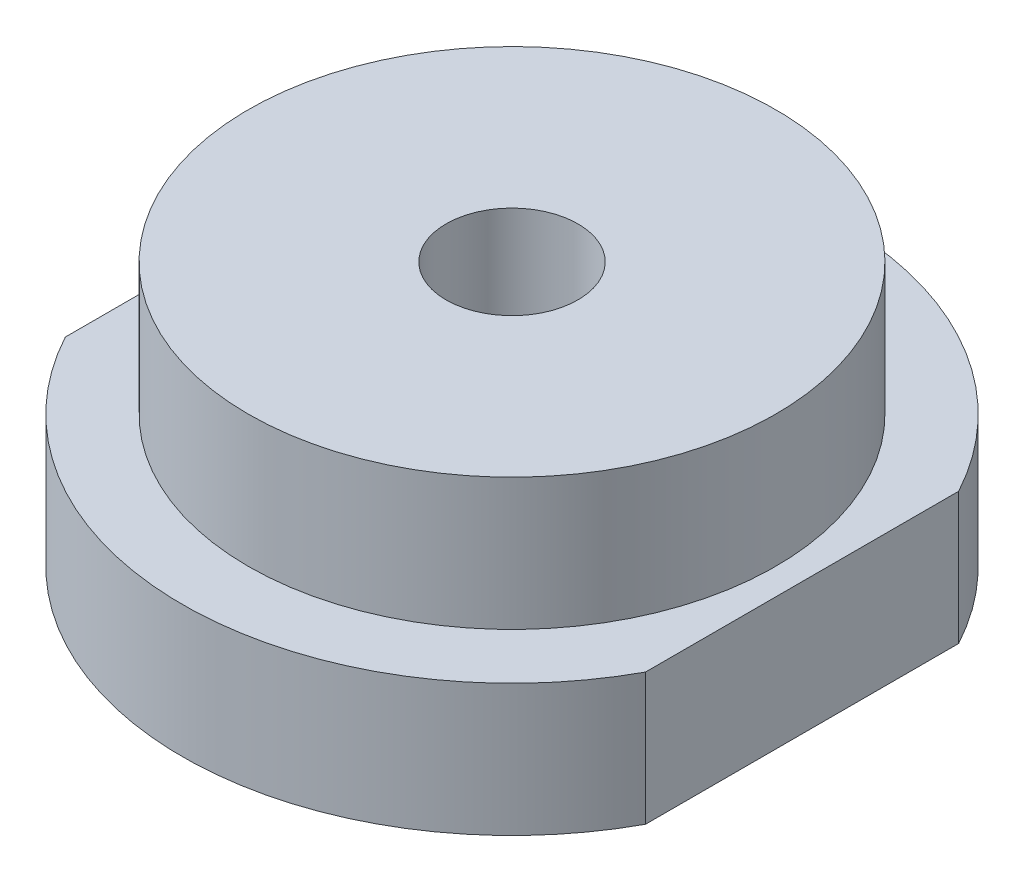
ISO-10303-21;
HEADER;
FILE_DESCRIPTION(('STEP AP214'),'2;1');
FILE_NAME('part.step','',(''),(''),'','','');
FILE_SCHEMA(('AUTOMOTIVE_DESIGN { 1 0 10303 214 1 1 1 1 }'));
ENDSEC;
DATA;
#1=APPLICATION_CONTEXT('core data for automotive mechanical design processes');
#2=APPLICATION_PROTOCOL_DEFINITION('international standard','automotive_design',2000,#1);
#3=PRODUCT_CONTEXT('',#1,'mechanical');
#4=PRODUCT('Part','Part','',(#3));
#5=PRODUCT_RELATED_PRODUCT_CATEGORY('part','',(#4));
#6=PRODUCT_DEFINITION_FORMATION('','',#4);
#7=PRODUCT_DEFINITION_CONTEXT('part definition',#1,'design');
#8=PRODUCT_DEFINITION('design','',#6,#7);
#9=PRODUCT_DEFINITION_SHAPE('','',#8);
#10=(LENGTH_UNIT() NAMED_UNIT(*) SI_UNIT(.MILLI.,.METRE.));
#11=(NAMED_UNIT(*) PLANE_ANGLE_UNIT() SI_UNIT($,.RADIAN.));
#12=(NAMED_UNIT(*) SI_UNIT($,.STERADIAN.) SOLID_ANGLE_UNIT());
#13=UNCERTAINTY_MEASURE_WITH_UNIT(LENGTH_MEASURE(1.E-05),#10,'distance_accuracy_value','');
#14=(GEOMETRIC_REPRESENTATION_CONTEXT(3) GLOBAL_UNCERTAINTY_ASSIGNED_CONTEXT((#13)) GLOBAL_UNIT_ASSIGNED_CONTEXT((#10,
#11,#12)) REPRESENTATION_CONTEXT('',''));
#15=CARTESIAN_POINT('',(0.,0.,0.));
#16=DIRECTION('',(0.,0.,1.));
#17=DIRECTION('',(1.,0.,0.));
#18=AXIS2_PLACEMENT_3D('',#15,#16,#17);
#19=CARTESIAN_POINT('',(0.,5.,0.));
#20=DIRECTION('',(0.,-1.,0.));
#21=DIRECTION('',(0.,0.,-1.));
#22=AXIS2_PLACEMENT_3D('',#19,#20,#21);
#23=CYLINDRICAL_SURFACE('',#22,12.5);
#24=CARTESIAN_POINT('',(0.,5.,0.));
#25=DIRECTION('',(0.,1.,0.));
#26=DIRECTION('',(0.,0.,1.));
#27=AXIS2_PLACEMENT_3D('',#24,#25,#26);
#28=CIRCLE('',#27,12.5);
#29=CARTESIAN_POINT('',(-11.,5.,5.93717104351897));
#30=VERTEX_POINT('',#29);
#31=CARTESIAN_POINT('',(11.,5.,5.93717104351896));
#32=VERTEX_POINT('',#31);
#33=EDGE_CURVE('E93',#30,#32,#28,.T.);
#34=ORIENTED_EDGE('',*,*,#33,.F.);
#35=DIRECTION('',(0.,1.,0.));
#36=VECTOR('',#35,1.);
#37=CARTESIAN_POINT('',(-11.,0.,5.93717104351897));
#38=LINE('',#37,#36);
#39=CARTESIAN_POINT('',(-11.,0.,5.93717104351897));
#40=VERTEX_POINT('',#39);
#41=EDGE_CURVE('E82',#40,#30,#38,.T.);
#42=ORIENTED_EDGE('',*,*,#41,.F.);
#43=CARTESIAN_POINT('',(0.,0.,0.));
#44=DIRECTION('',(0.,1.,0.));
#45=DIRECTION('',(0.,0.,1.));
#46=AXIS2_PLACEMENT_3D('',#43,#44,#45);
#47=CIRCLE('',#46,12.5);
#48=CARTESIAN_POINT('',(11.,0.,5.93717104351896));
#49=VERTEX_POINT('',#48);
#50=EDGE_CURVE('E43',#40,#49,#47,.T.);
#51=ORIENTED_EDGE('',*,*,#50,.T.);
#52=DIRECTION('',(0.,1.,0.));
#53=VECTOR('',#52,1.);
#54=CARTESIAN_POINT('',(11.,0.,5.93717104351896));
#55=LINE('',#54,#53);
#56=EDGE_CURVE('E64',#49,#32,#55,.T.);
#57=ORIENTED_EDGE('',*,*,#56,.T.);
#58=EDGE_LOOP('',(#34,#42,#51,#57));
#59=FACE_BOUND('',#58,.T.);
#60=ADVANCED_FACE('F39',(#59),#23,.T.);
#61=CARTESIAN_POINT('',(11.,0.,-5.93717104351896));
#62=VERTEX_POINT('',#61);
#63=CARTESIAN_POINT('',(-11.,0.,-5.93717104351896));
#64=VERTEX_POINT('',#63);
#65=EDGE_CURVE('E97',#62,#64,#47,.T.);
#66=ORIENTED_EDGE('',*,*,#65,.T.);
#67=DIRECTION('',(0.,1.,0.));
#68=VECTOR('',#67,1.);
#69=CARTESIAN_POINT('',(-11.,0.,-5.93717104351897));
#70=LINE('',#69,#68);
#71=CARTESIAN_POINT('',(-11.,5.,-5.93717104351897));
#72=VERTEX_POINT('',#71);
#73=EDGE_CURVE('E56',#64,#72,#70,.T.);
#74=ORIENTED_EDGE('',*,*,#73,.T.);
#75=CARTESIAN_POINT('',(11.,5.,-5.93717104351896));
#76=VERTEX_POINT('',#75);
#77=EDGE_CURVE('E48',#76,#72,#28,.T.);
#78=ORIENTED_EDGE('',*,*,#77,.F.);
#79=DIRECTION('',(0.,1.,0.));
#80=VECTOR('',#79,1.);
#81=CARTESIAN_POINT('',(11.,0.,-5.93717104351896));
#82=LINE('',#81,#80);
#83=EDGE_CURVE('E115',#62,#76,#82,.T.);
#84=ORIENTED_EDGE('',*,*,#83,.F.);
#85=EDGE_LOOP('',(#66,#74,#78,#84));
#86=FACE_BOUND('',#85,.T.);
#87=ADVANCED_FACE('F41',(#86),#23,.T.);
#88=CARTESIAN_POINT('',(0.,5.,0.));
#89=DIRECTION('',(0.,1.,0.));
#90=DIRECTION('',(0.,0.,1.));
#91=AXIS2_PLACEMENT_3D('',#88,#89,#90);
#92=PLANE('',#91);
#93=DIRECTION('',(0.,0.,-1.));
#94=VECTOR('',#93,1.);
#95=CARTESIAN_POINT('',(-11.,5.,0.));
#96=LINE('',#95,#94);
#97=EDGE_CURVE('E100',#30,#72,#96,.T.);
#98=ORIENTED_EDGE('',*,*,#97,.F.);
#99=ORIENTED_EDGE('',*,*,#33,.T.);
#100=DIRECTION('',(0.,0.,1.));
#101=VECTOR('',#100,1.);
#102=CARTESIAN_POINT('',(11.,5.,0.));
#103=LINE('',#102,#101);
#104=EDGE_CURVE('E104',#76,#32,#103,.T.);
#105=ORIENTED_EDGE('',*,*,#104,.F.);
#106=ORIENTED_EDGE('',*,*,#77,.T.);
#107=EDGE_LOOP('',(#98,#99,#105,#106));
#108=FACE_BOUND('',#107,.T.);
#109=CARTESIAN_POINT('',(0.,5.,0.));
#110=DIRECTION('',(0.,1.,0.));
#111=DIRECTION('',(0.,0.,1.));
#112=AXIS2_PLACEMENT_3D('',#109,#110,#111);
#113=CIRCLE('',#112,10.);
#114=CARTESIAN_POINT('',(0.,5.,10.));
#115=VERTEX_POINT('',#114);
#116=EDGE_CURVE('E11',#115,#115,#113,.T.);
#117=ORIENTED_EDGE('',*,*,#116,.F.);
#118=EDGE_LOOP('',(#117));
#119=FACE_BOUND('',#118,.T.);
#120=ADVANCED_FACE('F111',(#108,#119),#92,.T.);
#121=CARTESIAN_POINT('',(0.,0.,0.));
#122=DIRECTION('',(0.,1.,0.));
#123=DIRECTION('',(0.,0.,1.));
#124=AXIS2_PLACEMENT_3D('',#121,#122,#123);
#125=PLANE('',#124);
#126=CARTESIAN_POINT('',(0.,0.,0.));
#127=DIRECTION('',(0.,1.,0.));
#128=DIRECTION('',(0.,0.,1.));
#129=AXIS2_PLACEMENT_3D('',#126,#127,#128);
#130=CIRCLE('',#129,2.5);
#131=CARTESIAN_POINT('',(0.,0.,2.5));
#132=VERTEX_POINT('',#131);
#133=EDGE_CURVE('E119',#132,#132,#130,.T.);
#134=ORIENTED_EDGE('',*,*,#133,.T.);
#135=EDGE_LOOP('',(#134));
#136=FACE_BOUND('',#135,.T.);
#137=ORIENTED_EDGE('',*,*,#50,.F.);
#138=DIRECTION('',(0.,0.,-1.));
#139=VECTOR('',#138,1.);
#140=CARTESIAN_POINT('',(-11.,0.,-5.93717104351897));
#141=LINE('',#140,#139);
#142=EDGE_CURVE('E79',#40,#64,#141,.T.);
#143=ORIENTED_EDGE('',*,*,#142,.T.);
#144=ORIENTED_EDGE('',*,*,#65,.F.);
#145=DIRECTION('',(0.,0.,1.));
#146=VECTOR('',#145,1.);
#147=CARTESIAN_POINT('',(11.,0.,-5.93717104351896));
#148=LINE('',#147,#146);
#149=EDGE_CURVE('E96',#62,#49,#148,.T.);
#150=ORIENTED_EDGE('',*,*,#149,.T.);
#151=EDGE_LOOP('',(#137,#143,#144,#150));
#152=FACE_BOUND('',#151,.T.);
#153=ADVANCED_FACE('F95',(#136,#152),#125,.F.);
#154=CARTESIAN_POINT('',(0.,10.,0.));
#155=DIRECTION('',(0.,-1.,0.));
#156=DIRECTION('',(0.,0.,-1.));
#157=AXIS2_PLACEMENT_3D('',#154,#155,#156);
#158=CYLINDRICAL_SURFACE('',#157,10.);
#159=CARTESIAN_POINT('',(0.,10.,0.));
#160=DIRECTION('',(0.,1.,0.));
#161=DIRECTION('',(0.,0.,1.));
#162=AXIS2_PLACEMENT_3D('',#159,#160,#161);
#163=CIRCLE('',#162,10.);
#164=CARTESIAN_POINT('',(0.,10.,10.));
#165=VERTEX_POINT('',#164);
#166=EDGE_CURVE('E98',#165,#165,#163,.T.);
#167=ORIENTED_EDGE('',*,*,#166,.F.);
#168=EDGE_LOOP('',(#167));
#169=FACE_BOUND('',#168,.T.);
#170=ORIENTED_EDGE('',*,*,#116,.T.);
#171=EDGE_LOOP('',(#170));
#172=FACE_BOUND('',#171,.T.);
#173=ADVANCED_FACE('F132',(#169,#172),#158,.T.);
#174=CARTESIAN_POINT('',(0.,10.,0.));
#175=DIRECTION('',(0.,1.,0.));
#176=DIRECTION('',(0.,0.,1.));
#177=AXIS2_PLACEMENT_3D('',#174,#175,#176);
#178=PLANE('',#177);
#179=CARTESIAN_POINT('',(0.,10.,0.));
#180=DIRECTION('',(0.,1.,0.));
#181=DIRECTION('',(0.,0.,1.));
#182=AXIS2_PLACEMENT_3D('',#179,#180,#181);
#183=CIRCLE('',#182,2.5);
#184=CARTESIAN_POINT('',(0.,10.,2.5));
#185=VERTEX_POINT('',#184);
#186=EDGE_CURVE('E124',#185,#185,#183,.T.);
#187=ORIENTED_EDGE('',*,*,#186,.F.);
#188=EDGE_LOOP('',(#187));
#189=FACE_BOUND('',#188,.T.);
#190=ORIENTED_EDGE('',*,*,#166,.T.);
#191=EDGE_LOOP('',(#190));
#192=FACE_BOUND('',#191,.T.);
#193=ADVANCED_FACE('F130',(#189,#192),#178,.T.);
#194=CARTESIAN_POINT('',(0.,0.,0.));
#195=DIRECTION('',(0.,1.,0.));
#196=DIRECTION('',(0.,0.,1.));
#197=AXIS2_PLACEMENT_3D('',#194,#195,#196);
#198=CYLINDRICAL_SURFACE('',#197,2.5);
#199=ORIENTED_EDGE('',*,*,#133,.F.);
#200=EDGE_LOOP('',(#199));
#201=FACE_BOUND('',#200,.T.);
#202=ORIENTED_EDGE('',*,*,#186,.T.);
#203=EDGE_LOOP('',(#202));
#204=FACE_BOUND('',#203,.T.);
#205=ADVANCED_FACE('F128',(#201,#204),#198,.F.);
#206=CARTESIAN_POINT('',(11.,0.,-5.93717104351896));
#207=DIRECTION('',(-1.,0.,0.));
#208=DIRECTION('',(0.,0.,1.));
#209=AXIS2_PLACEMENT_3D('',#206,#207,#208);
#210=PLANE('',#209);
#211=ORIENTED_EDGE('',*,*,#104,.T.);
#212=ORIENTED_EDGE('',*,*,#56,.F.);
#213=ORIENTED_EDGE('',*,*,#149,.F.);
#214=ORIENTED_EDGE('',*,*,#83,.T.);
#215=EDGE_LOOP('',(#211,#212,#213,#214));
#216=FACE_BOUND('',#215,.T.);
#217=ADVANCED_FACE('F138',(#216),#210,.F.);
#218=CARTESIAN_POINT('',(-11.,0.,-5.93717104351897));
#219=DIRECTION('',(1.,0.,0.));
#220=DIRECTION('',(0.,0.,-1.));
#221=AXIS2_PLACEMENT_3D('',#218,#219,#220);
#222=PLANE('',#221);
#223=ORIENTED_EDGE('',*,*,#97,.T.);
#224=ORIENTED_EDGE('',*,*,#73,.F.);
#225=ORIENTED_EDGE('',*,*,#142,.F.);
#226=ORIENTED_EDGE('',*,*,#41,.T.);
#227=EDGE_LOOP('',(#223,#224,#225,#226));
#228=FACE_BOUND('',#227,.T.);
#229=ADVANCED_FACE('F81',(#228),#222,.F.);
#230=CLOSED_SHELL('',(#60,#87,#120,#153,#173,#193,#205,#217,#229));
#231=MANIFOLD_SOLID_BREP('B2',#230);
#232=ADVANCED_BREP_SHAPE_REPRESENTATION('',(#18,#231),#14);
#233=SHAPE_DEFINITION_REPRESENTATION(#9,#232);
ENDSEC;
END-ISO-10303-21;
